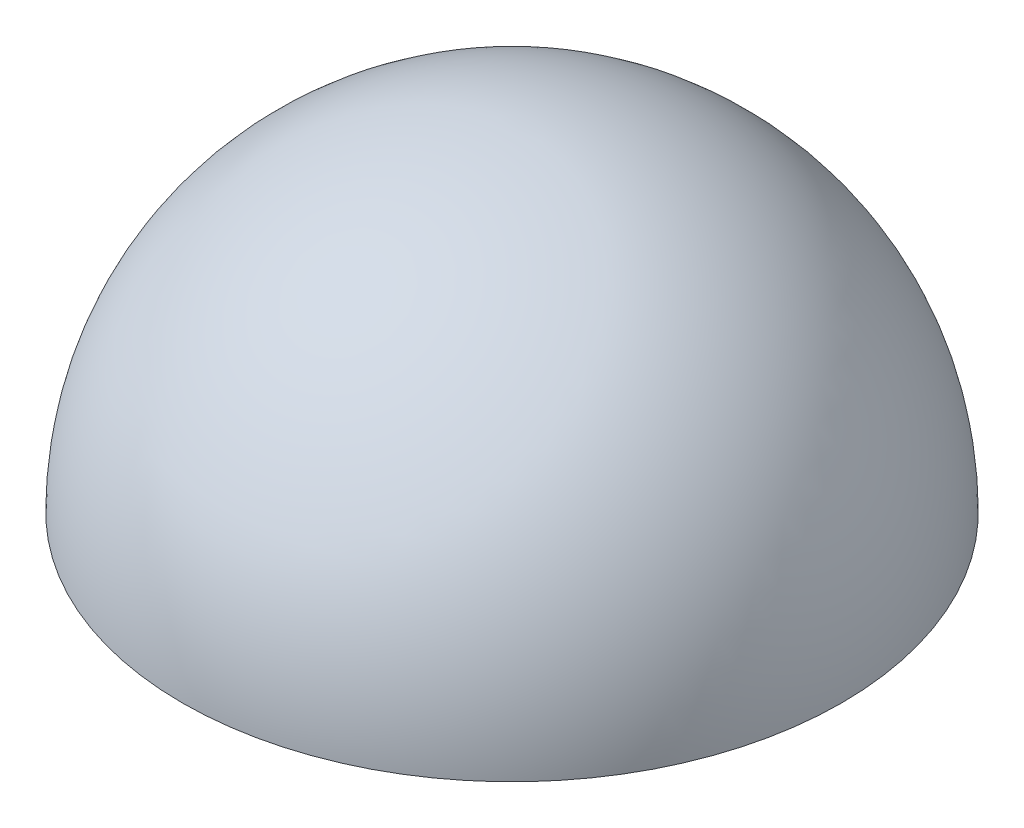
ISO-10303-21;
HEADER;
FILE_DESCRIPTION(('STEP AP214'),'2;1');
FILE_NAME('part.step','',(''),(''),'','','');
FILE_SCHEMA(('AUTOMOTIVE_DESIGN { 1 0 10303 214 1 1 1 1 }'));
ENDSEC;
DATA;
#1=APPLICATION_CONTEXT('core data for automotive mechanical design processes');
#2=APPLICATION_PROTOCOL_DEFINITION('international standard','automotive_design',2000,#1);
#3=PRODUCT_CONTEXT('',#1,'mechanical');
#4=PRODUCT('Part','Part','',(#3));
#5=PRODUCT_RELATED_PRODUCT_CATEGORY('part','',(#4));
#6=PRODUCT_DEFINITION_FORMATION('','',#4);
#7=PRODUCT_DEFINITION_CONTEXT('part definition',#1,'design');
#8=PRODUCT_DEFINITION('design','',#6,#7);
#9=PRODUCT_DEFINITION_SHAPE('','',#8);
#10=(LENGTH_UNIT() NAMED_UNIT(*) SI_UNIT(.MILLI.,.METRE.));
#11=(NAMED_UNIT(*) PLANE_ANGLE_UNIT() SI_UNIT($,.RADIAN.));
#12=(NAMED_UNIT(*) SI_UNIT($,.STERADIAN.) SOLID_ANGLE_UNIT());
#13=UNCERTAINTY_MEASURE_WITH_UNIT(LENGTH_MEASURE(1.E-05),#10,'distance_accuracy_value','');
#14=(GEOMETRIC_REPRESENTATION_CONTEXT(3) GLOBAL_UNCERTAINTY_ASSIGNED_CONTEXT((#13)) GLOBAL_UNIT_ASSIGNED_CONTEXT((#10,
#11,#12)) REPRESENTATION_CONTEXT('',''));
#15=CARTESIAN_POINT('',(0.,0.,0.));
#16=DIRECTION('',(0.,0.,1.));
#17=DIRECTION('',(1.,0.,0.));
#18=AXIS2_PLACEMENT_3D('',#15,#16,#17);
#19=CARTESIAN_POINT('',(0.,0.,0.));
#20=DIRECTION('',(0.,-1.,0.));
#21=DIRECTION('',(1.,0.,0.));
#22=AXIS2_PLACEMENT_3D('',#19,#20,#21);
#23=SPHERICAL_SURFACE('',#22,70.);
#24=CARTESIAN_POINT('',(0.,0.,0.));
#25=DIRECTION('',(0.,-1.,0.));
#26=DIRECTION('',(0.,0.,-1.));
#27=AXIS2_PLACEMENT_3D('',#24,#25,#26);
#28=CIRCLE('',#27,70.);
#29=CARTESIAN_POINT('',(0.,0.,-70.));
#30=VERTEX_POINT('',#29);
#31=EDGE_CURVE('E10',#30,#30,#28,.T.);
#32=ORIENTED_EDGE('',*,*,#31,.F.);
#33=EDGE_LOOP('',(#32));
#34=FACE_BOUND('',#33,.T.);
#35=ADVANCED_FACE('F33',(#34),#23,.T.);
#36=CARTESIAN_POINT('',(0.,0.,0.));
#37=DIRECTION('',(0.,-1.,0.));
#38=DIRECTION('',(0.,0.,-1.));
#39=AXIS2_PLACEMENT_3D('',#36,#37,#38);
#40=PLANE('',#39);
#41=ORIENTED_EDGE('',*,*,#31,.T.);
#42=EDGE_LOOP('',(#41));
#43=FACE_BOUND('',#42,.T.);
#44=ADVANCED_FACE('F40',(#43),#40,.T.);
#45=CLOSED_SHELL('',(#35,#44));
#46=MANIFOLD_SOLID_BREP('B2',#45);
#47=ADVANCED_BREP_SHAPE_REPRESENTATION('',(#18,#46),#14);
#48=SHAPE_DEFINITION_REPRESENTATION(#9,#47);
ENDSEC;
END-ISO-10303-21;
